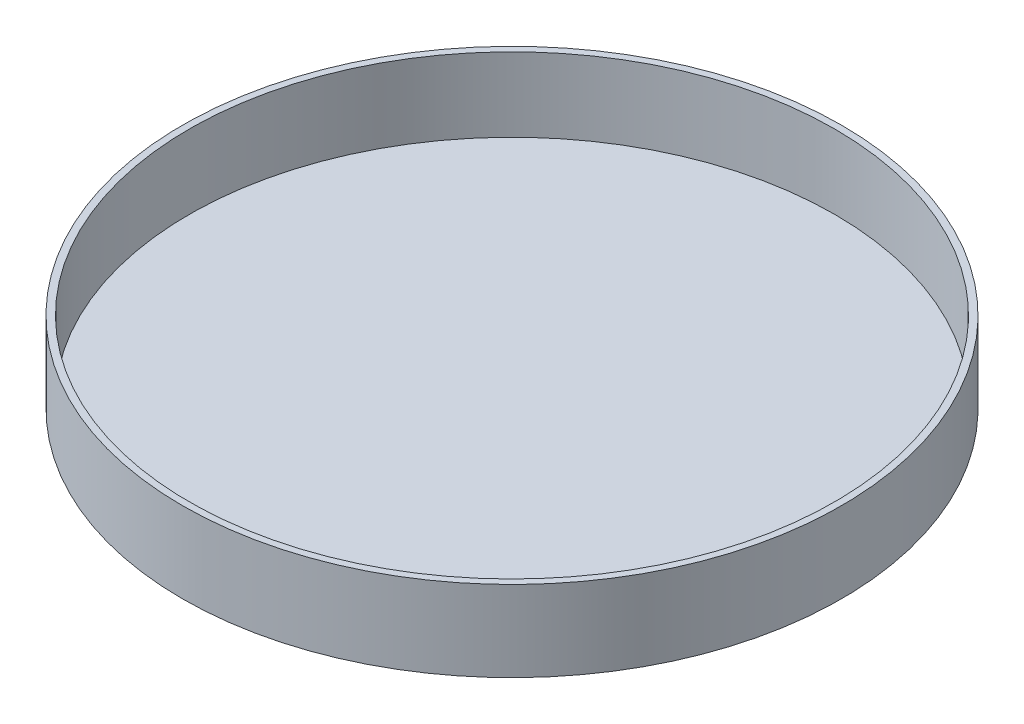
ISO-10303-21;
HEADER;
FILE_DESCRIPTION(('STEP AP214'),'2;1');
FILE_NAME('part.step','',(''),(''),'','','');
FILE_SCHEMA(('AUTOMOTIVE_DESIGN { 1 0 10303 214 1 1 1 1 }'));
ENDSEC;
DATA;
#1=APPLICATION_CONTEXT('core data for automotive mechanical design processes');
#2=APPLICATION_PROTOCOL_DEFINITION('international standard','automotive_design',2000,#1);
#3=PRODUCT_CONTEXT('',#1,'mechanical');
#4=PRODUCT('Part','Part','',(#3));
#5=PRODUCT_RELATED_PRODUCT_CATEGORY('part','',(#4));
#6=PRODUCT_DEFINITION_FORMATION('','',#4);
#7=PRODUCT_DEFINITION_CONTEXT('part definition',#1,'design');
#8=PRODUCT_DEFINITION('design','',#6,#7);
#9=PRODUCT_DEFINITION_SHAPE('','',#8);
#10=(LENGTH_UNIT() NAMED_UNIT(*) SI_UNIT(.MILLI.,.METRE.));
#11=(NAMED_UNIT(*) PLANE_ANGLE_UNIT() SI_UNIT($,.RADIAN.));
#12=(NAMED_UNIT(*) SI_UNIT($,.STERADIAN.) SOLID_ANGLE_UNIT());
#13=UNCERTAINTY_MEASURE_WITH_UNIT(LENGTH_MEASURE(1.E-05),#10,'distance_accuracy_value','');
#14=(GEOMETRIC_REPRESENTATION_CONTEXT(3) GLOBAL_UNCERTAINTY_ASSIGNED_CONTEXT((#13)) GLOBAL_UNIT_ASSIGNED_CONTEXT((#10,
#11,#12)) REPRESENTATION_CONTEXT('',''));
#15=CARTESIAN_POINT('',(0.,0.,0.));
#16=DIRECTION('',(0.,0.,1.));
#17=DIRECTION('',(1.,0.,0.));
#18=AXIS2_PLACEMENT_3D('',#15,#16,#17);
#19=CARTESIAN_POINT('',(0.,0.,0.));
#20=DIRECTION('',(0.,1.,0.));
#21=DIRECTION('',(0.,0.,1.));
#22=AXIS2_PLACEMENT_3D('',#19,#20,#21);
#23=PLANE('',#22);
#24=CARTESIAN_POINT('',(0.,0.,0.));
#25=DIRECTION('',(0.,-1.,0.));
#26=DIRECTION('',(0.,0.,-1.));
#27=AXIS2_PLACEMENT_3D('',#24,#25,#26);
#28=CIRCLE('',#27,311.15);
#29=CARTESIAN_POINT('',(0.,0.,-311.15));
#30=VERTEX_POINT('',#29);
#31=EDGE_CURVE('E12',#30,#30,#28,.T.);
#32=ORIENTED_EDGE('',*,*,#31,.T.);
#33=EDGE_LOOP('',(#32));
#34=FACE_BOUND('',#33,.T.);
#35=ADVANCED_FACE('F48',(#34),#23,.F.);
#36=CARTESIAN_POINT('',(0.,-45.633687212475,0.));
#37=DIRECTION('',(0.,-1.,0.));
#38=DIRECTION('',(0.,0.,-1.));
#39=AXIS2_PLACEMENT_3D('',#36,#37,#38);
#40=CYLINDRICAL_SURFACE('',#39,311.15);
#41=ORIENTED_EDGE('',*,*,#31,.F.);
#42=EDGE_LOOP('',(#41));
#43=FACE_BOUND('',#42,.T.);
#44=CARTESIAN_POINT('',(0.,76.2,0.));
#45=DIRECTION('',(0.,-1.,0.));
#46=DIRECTION('',(0.,0.,-1.));
#47=AXIS2_PLACEMENT_3D('',#44,#45,#46);
#48=CIRCLE('',#47,311.15);
#49=CARTESIAN_POINT('',(0.,76.2,-311.15));
#50=VERTEX_POINT('',#49);
#51=EDGE_CURVE('E55',#50,#50,#48,.T.);
#52=ORIENTED_EDGE('',*,*,#51,.T.);
#53=EDGE_LOOP('',(#52));
#54=FACE_BOUND('',#53,.T.);
#55=ADVANCED_FACE('F87',(#43,#54),#40,.T.);
#56=CARTESIAN_POINT('',(0.,76.2,311.15));
#57=DIRECTION('',(0.,-1.,0.));
#58=DIRECTION('',(0.,0.,-1.));
#59=AXIS2_PLACEMENT_3D('',#56,#57,#58);
#60=PLANE('',#59);
#61=ORIENTED_EDGE('',*,*,#51,.F.);
#62=EDGE_LOOP('',(#61));
#63=FACE_BOUND('',#62,.T.);
#64=CARTESIAN_POINT('',(0.,76.2,0.));
#65=DIRECTION('',(0.,-1.,0.));
#66=DIRECTION('',(0.,0.,-1.));
#67=AXIS2_PLACEMENT_3D('',#64,#65,#66);
#68=CIRCLE('',#67,304.8);
#69=CARTESIAN_POINT('',(0.,76.2,-304.8));
#70=VERTEX_POINT('',#69);
#71=EDGE_CURVE('E61',#70,#70,#68,.T.);
#72=ORIENTED_EDGE('',*,*,#71,.T.);
#73=EDGE_LOOP('',(#72));
#74=FACE_BOUND('',#73,.T.);
#75=ADVANCED_FACE('F83',(#63,#74),#60,.F.);
#76=CARTESIAN_POINT('',(0.,-45.633687212475,0.));
#77=DIRECTION('',(0.,-1.,0.));
#78=DIRECTION('',(0.,0.,-1.));
#79=AXIS2_PLACEMENT_3D('',#76,#77,#78);
#80=CYLINDRICAL_SURFACE('',#79,304.8);
#81=ORIENTED_EDGE('',*,*,#71,.F.);
#82=EDGE_LOOP('',(#81));
#83=FACE_BOUND('',#82,.T.);
#84=CARTESIAN_POINT('',(0.,6.35000000000004,0.));
#85=DIRECTION('',(0.,-1.,0.));
#86=DIRECTION('',(0.,0.,-1.));
#87=AXIS2_PLACEMENT_3D('',#84,#85,#86);
#88=CIRCLE('',#87,304.8);
#89=CARTESIAN_POINT('',(0.,6.35000000000004,-304.8));
#90=VERTEX_POINT('',#89);
#91=EDGE_CURVE('E67',#90,#90,#88,.T.);
#92=ORIENTED_EDGE('',*,*,#91,.T.);
#93=EDGE_LOOP('',(#92));
#94=FACE_BOUND('',#93,.T.);
#95=ADVANCED_FACE('F75',(#83,#94),#80,.F.);
#96=CARTESIAN_POINT('',(0.,6.35000000000004,304.8));
#97=DIRECTION('',(0.,-1.,0.));
#98=DIRECTION('',(0.,0.,-1.));
#99=AXIS2_PLACEMENT_3D('',#96,#97,#98);
#100=PLANE('',#99);
#101=ORIENTED_EDGE('',*,*,#91,.F.);
#102=EDGE_LOOP('',(#101));
#103=FACE_BOUND('',#102,.T.);
#104=ADVANCED_FACE('F77',(#103),#100,.F.);
#105=CLOSED_SHELL('',(#35,#55,#75,#95,#104));
#106=MANIFOLD_SOLID_BREP('B2',#105);
#107=ADVANCED_BREP_SHAPE_REPRESENTATION('',(#18,#106),#14);
#108=SHAPE_DEFINITION_REPRESENTATION(#9,#107);
ENDSEC;
END-ISO-10303-21;
